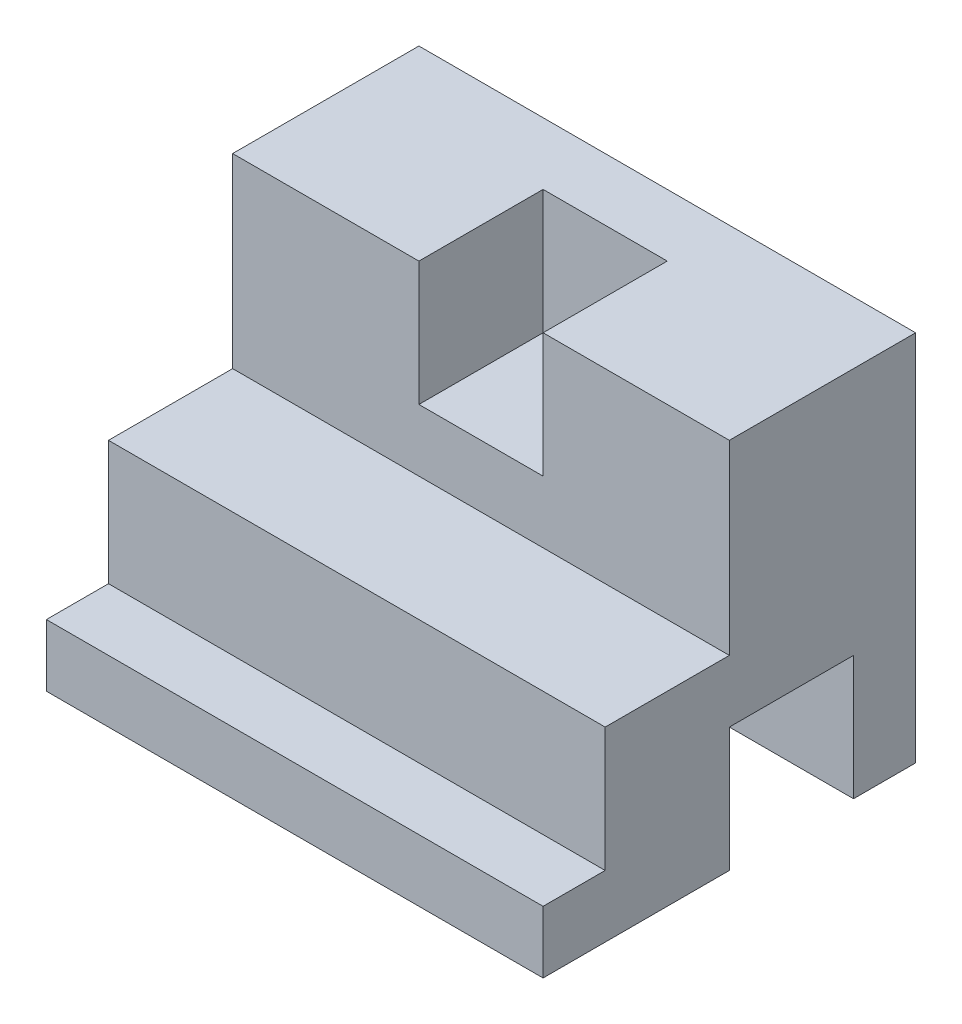
ISO-10303-21;
HEADER;
FILE_DESCRIPTION(('STEP AP214'),'2;1');
FILE_NAME('part.step','',(''),(''),'','','');
FILE_SCHEMA(('AUTOMOTIVE_DESIGN { 1 0 10303 214 1 1 1 1 }'));
ENDSEC;
DATA;
#1=APPLICATION_CONTEXT('core data for automotive mechanical design processes');
#2=APPLICATION_PROTOCOL_DEFINITION('international standard','automotive_design',2000,#1);
#3=PRODUCT_CONTEXT('',#1,'mechanical');
#4=PRODUCT('Part','Part','',(#3));
#5=PRODUCT_RELATED_PRODUCT_CATEGORY('part','',(#4));
#6=PRODUCT_DEFINITION_FORMATION('','',#4);
#7=PRODUCT_DEFINITION_CONTEXT('part definition',#1,'design');
#8=PRODUCT_DEFINITION('design','',#6,#7);
#9=PRODUCT_DEFINITION_SHAPE('','',#8);
#10=(LENGTH_UNIT() NAMED_UNIT(*) SI_UNIT(.MILLI.,.METRE.));
#11=(NAMED_UNIT(*) PLANE_ANGLE_UNIT() SI_UNIT($,.RADIAN.));
#12=(NAMED_UNIT(*) SI_UNIT($,.STERADIAN.) SOLID_ANGLE_UNIT());
#13=UNCERTAINTY_MEASURE_WITH_UNIT(LENGTH_MEASURE(1.E-05),#10,'distance_accuracy_value','');
#14=(GEOMETRIC_REPRESENTATION_CONTEXT(3) GLOBAL_UNCERTAINTY_ASSIGNED_CONTEXT((#13)) GLOBAL_UNIT_ASSIGNED_CONTEXT((#10,
#11,#12)) REPRESENTATION_CONTEXT('',''));
#15=CARTESIAN_POINT('',(0.,0.,0.));
#16=DIRECTION('',(0.,0.,1.));
#17=DIRECTION('',(1.,0.,0.));
#18=AXIS2_PLACEMENT_3D('',#15,#16,#17);
#19=CARTESIAN_POINT('',(0.,0.,-152.4));
#20=DIRECTION('',(0.,-1.,0.));
#21=DIRECTION('',(0.,0.,-1.));
#22=AXIS2_PLACEMENT_3D('',#19,#20,#21);
#23=PLANE('',#22);
#24=DIRECTION('',(1.,0.,0.));
#25=VECTOR('',#24,1.);
#26=CARTESIAN_POINT('',(0.,0.,-76.2));
#27=LINE('',#26,#25);
#28=CARTESIAN_POINT('',(0.,0.,-76.2));
#29=VERTEX_POINT('',#28);
#30=CARTESIAN_POINT('',(203.2,0.,-76.2));
#31=VERTEX_POINT('',#30);
#32=EDGE_CURVE('E192',#29,#31,#27,.T.);
#33=ORIENTED_EDGE('',*,*,#32,.T.);
#34=DIRECTION('',(0.,0.,1.));
#35=VECTOR('',#34,1.);
#36=CARTESIAN_POINT('',(203.2,0.,-152.4));
#37=LINE('',#36,#35);
#38=CARTESIAN_POINT('',(203.2,0.,0.));
#39=VERTEX_POINT('',#38);
#40=EDGE_CURVE('E259',#31,#39,#37,.T.);
#41=ORIENTED_EDGE('',*,*,#40,.T.);
#42=DIRECTION('',(1.,0.,0.));
#43=VECTOR('',#42,1.);
#44=CARTESIAN_POINT('',(0.,0.,0.));
#45=LINE('',#44,#43);
#46=CARTESIAN_POINT('',(0.,0.,0.));
#47=VERTEX_POINT('',#46);
#48=EDGE_CURVE('E251',#47,#39,#45,.T.);
#49=ORIENTED_EDGE('',*,*,#48,.F.);
#50=DIRECTION('',(0.,0.,1.));
#51=VECTOR('',#50,1.);
#52=CARTESIAN_POINT('',(0.,0.,-152.4));
#53=LINE('',#52,#51);
#54=EDGE_CURVE('E248',#29,#47,#53,.T.);
#55=ORIENTED_EDGE('',*,*,#54,.F.);
#56=EDGE_LOOP('',(#33,#41,#49,#55));
#57=FACE_BOUND('',#56,.T.);
#58=ADVANCED_FACE('F33',(#57),#23,.T.);
#59=CARTESIAN_POINT('',(0.,0.,-152.4));
#60=DIRECTION('',(-1.,0.,0.));
#61=DIRECTION('',(0.,0.,1.));
#62=AXIS2_PLACEMENT_3D('',#59,#60,#61);
#63=PLANE('',#62);
#64=DIRECTION('',(0.,-1.,0.));
#65=VECTOR('',#64,1.);
#66=CARTESIAN_POINT('',(0.,0.,-76.2));
#67=LINE('',#66,#65);
#68=CARTESIAN_POINT('',(0.,50.8,-76.2));
#69=VERTEX_POINT('',#68);
#70=EDGE_CURVE('E181',#69,#29,#67,.T.);
#71=ORIENTED_EDGE('',*,*,#70,.T.);
#72=ORIENTED_EDGE('',*,*,#54,.T.);
#73=DIRECTION('',(0.,-1.,0.));
#74=VECTOR('',#73,1.);
#75=CARTESIAN_POINT('',(0.,0.,0.));
#76=LINE('',#75,#74);
#77=CARTESIAN_POINT('',(0.,25.4,0.));
#78=VERTEX_POINT('',#77);
#79=EDGE_CURVE('E227',#78,#47,#76,.T.);
#80=ORIENTED_EDGE('',*,*,#79,.F.);
#81=DIRECTION('',(0.,0.,-1.));
#82=VECTOR('',#81,1.);
#83=CARTESIAN_POINT('',(0.,25.4,0.));
#84=LINE('',#83,#82);
#85=CARTESIAN_POINT('',(0.,25.4,-25.4));
#86=VERTEX_POINT('',#85);
#87=EDGE_CURVE('E201',#78,#86,#84,.T.);
#88=ORIENTED_EDGE('',*,*,#87,.T.);
#89=DIRECTION('',(0.,1.,0.));
#90=VECTOR('',#89,1.);
#91=CARTESIAN_POINT('',(0.,25.4,-25.4));
#92=LINE('',#91,#90);
#93=CARTESIAN_POINT('',(0.,76.2,-25.4));
#94=VERTEX_POINT('',#93);
#95=EDGE_CURVE('E204',#86,#94,#92,.T.);
#96=ORIENTED_EDGE('',*,*,#95,.T.);
#97=DIRECTION('',(0.,0.,-1.));
#98=VECTOR('',#97,1.);
#99=CARTESIAN_POINT('',(0.,76.2,-25.4));
#100=LINE('',#99,#98);
#101=CARTESIAN_POINT('',(0.,76.2,-76.2));
#102=VERTEX_POINT('',#101);
#103=EDGE_CURVE('E208',#94,#102,#100,.T.);
#104=ORIENTED_EDGE('',*,*,#103,.T.);
#105=DIRECTION('',(0.,1.,0.));
#106=VECTOR('',#105,1.);
#107=CARTESIAN_POINT('',(0.,76.2,-76.2));
#108=LINE('',#107,#106);
#109=CARTESIAN_POINT('',(0.,152.4,-76.2));
#110=VERTEX_POINT('',#109);
#111=EDGE_CURVE('E211',#102,#110,#108,.T.);
#112=ORIENTED_EDGE('',*,*,#111,.T.);
#113=DIRECTION('',(0.,0.,1.));
#114=VECTOR('',#113,1.);
#115=CARTESIAN_POINT('',(0.,152.4,-152.4));
#116=LINE('',#115,#114);
#117=CARTESIAN_POINT('',(0.,152.4,-152.4));
#118=VERTEX_POINT('',#117);
#119=EDGE_CURVE('E11',#118,#110,#116,.T.);
#120=ORIENTED_EDGE('',*,*,#119,.F.);
#121=DIRECTION('',(0.,-1.,0.));
#122=VECTOR('',#121,1.);
#123=CARTESIAN_POINT('',(0.,0.,-152.4));
#124=LINE('',#123,#122);
#125=CARTESIAN_POINT('',(0.,0.,-152.4));
#126=VERTEX_POINT('',#125);
#127=EDGE_CURVE('E235',#118,#126,#124,.T.);
#128=ORIENTED_EDGE('',*,*,#127,.T.);
#129=CARTESIAN_POINT('',(0.,0.,-127.));
#130=VERTEX_POINT('',#129);
#131=EDGE_CURVE('E37',#126,#130,#53,.T.);
#132=ORIENTED_EDGE('',*,*,#131,.T.);
#133=DIRECTION('',(0.,1.,0.));
#134=VECTOR('',#133,1.);
#135=CARTESIAN_POINT('',(0.,50.8,-127.));
#136=LINE('',#135,#134);
#137=CARTESIAN_POINT('',(0.,50.8,-127.));
#138=VERTEX_POINT('',#137);
#139=EDGE_CURVE('E58',#130,#138,#136,.T.);
#140=ORIENTED_EDGE('',*,*,#139,.T.);
#141=DIRECTION('',(0.,0.,1.));
#142=VECTOR('',#141,1.);
#143=CARTESIAN_POINT('',(0.,50.8,-76.2));
#144=LINE('',#143,#142);
#145=EDGE_CURVE('E177',#138,#69,#144,.T.);
#146=ORIENTED_EDGE('',*,*,#145,.T.);
#147=EDGE_LOOP('',(#71,#72,#80,#88,#96,#104,#112,#120,#128,#132,#140,#146));
#148=FACE_BOUND('',#147,.T.);
#149=ADVANCED_FACE('F35',(#148),#63,.T.);
#150=CARTESIAN_POINT('',(0.,152.4,-152.4));
#151=DIRECTION('',(0.,1.,0.));
#152=DIRECTION('',(0.,0.,1.));
#153=AXIS2_PLACEMENT_3D('',#150,#151,#152);
#154=PLANE('',#153);
#155=DIRECTION('',(0.,0.,1.));
#156=VECTOR('',#155,1.);
#157=CARTESIAN_POINT('',(76.2,152.4,-76.2));
#158=LINE('',#157,#156);
#159=CARTESIAN_POINT('',(76.2,152.4,-127.));
#160=VERTEX_POINT('',#159);
#161=CARTESIAN_POINT('',(76.2,152.4,-76.2));
#162=VERTEX_POINT('',#161);
#163=EDGE_CURVE('E335',#160,#162,#158,.T.);
#164=ORIENTED_EDGE('',*,*,#163,.F.);
#165=DIRECTION('',(-1.,0.,0.));
#166=VECTOR('',#165,1.);
#167=CARTESIAN_POINT('',(76.2,152.4,-127.));
#168=LINE('',#167,#166);
#169=CARTESIAN_POINT('',(127.,152.4,-127.));
#170=VERTEX_POINT('',#169);
#171=EDGE_CURVE('E337',#170,#160,#168,.T.);
#172=ORIENTED_EDGE('',*,*,#171,.F.);
#173=DIRECTION('',(0.,0.,-1.));
#174=VECTOR('',#173,1.);
#175=CARTESIAN_POINT('',(127.,152.4,-76.2));
#176=LINE('',#175,#174);
#177=CARTESIAN_POINT('',(127.,152.4,-76.2));
#178=VERTEX_POINT('',#177);
#179=EDGE_CURVE('E339',#178,#170,#176,.T.);
#180=ORIENTED_EDGE('',*,*,#179,.F.);
#181=DIRECTION('',(1.,0.,0.));
#182=VECTOR('',#181,1.);
#183=CARTESIAN_POINT('',(0.,152.4,-76.2));
#184=LINE('',#183,#182);
#185=CARTESIAN_POINT('',(203.2,152.4,-76.2));
#186=VERTEX_POINT('',#185);
#187=EDGE_CURVE('E168',#178,#186,#184,.T.);
#188=ORIENTED_EDGE('',*,*,#187,.T.);
#189=DIRECTION('',(0.,0.,1.));
#190=VECTOR('',#189,1.);
#191=CARTESIAN_POINT('',(203.2,152.4,-152.4));
#192=LINE('',#191,#190);
#193=CARTESIAN_POINT('',(203.2,152.4,-152.4));
#194=VERTEX_POINT('',#193);
#195=EDGE_CURVE('E42',#194,#186,#192,.T.);
#196=ORIENTED_EDGE('',*,*,#195,.F.);
#197=DIRECTION('',(-1.,0.,0.));
#198=VECTOR('',#197,1.);
#199=CARTESIAN_POINT('',(0.,152.4,-152.4));
#200=LINE('',#199,#198);
#201=EDGE_CURVE('E245',#194,#118,#200,.T.);
#202=ORIENTED_EDGE('',*,*,#201,.T.);
#203=ORIENTED_EDGE('',*,*,#119,.T.);
#204=EDGE_CURVE('E224',#110,#162,#184,.T.);
#205=ORIENTED_EDGE('',*,*,#204,.T.);
#206=EDGE_LOOP('',(#164,#172,#180,#188,#196,#202,#203,#205));
#207=FACE_BOUND('',#206,.T.);
#208=ADVANCED_FACE('F278',(#207),#154,.T.);
#209=CARTESIAN_POINT('',(203.2,0.,-152.4));
#210=DIRECTION('',(1.,0.,0.));
#211=DIRECTION('',(0.,0.,-1.));
#212=AXIS2_PLACEMENT_3D('',#209,#210,#211);
#213=PLANE('',#212);
#214=DIRECTION('',(0.,-1.,0.));
#215=VECTOR('',#214,1.);
#216=CARTESIAN_POINT('',(203.2,0.,-76.2));
#217=LINE('',#216,#215);
#218=CARTESIAN_POINT('',(203.2,50.8,-76.2));
#219=VERTEX_POINT('',#218);
#220=EDGE_CURVE('E178',#219,#31,#217,.T.);
#221=ORIENTED_EDGE('',*,*,#220,.F.);
#222=DIRECTION('',(0.,0.,1.));
#223=VECTOR('',#222,1.);
#224=CARTESIAN_POINT('',(203.2,50.8,-76.2));
#225=LINE('',#224,#223);
#226=CARTESIAN_POINT('',(203.2,50.8,-127.));
#227=VERTEX_POINT('',#226);
#228=EDGE_CURVE('E188',#227,#219,#225,.T.);
#229=ORIENTED_EDGE('',*,*,#228,.F.);
#230=DIRECTION('',(0.,1.,0.));
#231=VECTOR('',#230,1.);
#232=CARTESIAN_POINT('',(203.2,50.8,-127.));
#233=LINE('',#232,#231);
#234=CARTESIAN_POINT('',(203.2,0.,-127.));
#235=VERTEX_POINT('',#234);
#236=EDGE_CURVE('E185',#235,#227,#233,.T.);
#237=ORIENTED_EDGE('',*,*,#236,.F.);
#238=CARTESIAN_POINT('',(203.2,0.,-152.4));
#239=VERTEX_POINT('',#238);
#240=EDGE_CURVE('E257',#239,#235,#37,.T.);
#241=ORIENTED_EDGE('',*,*,#240,.F.);
#242=DIRECTION('',(0.,1.,0.));
#243=VECTOR('',#242,1.);
#244=CARTESIAN_POINT('',(203.2,0.,-152.4));
#245=LINE('',#244,#243);
#246=EDGE_CURVE('E242',#239,#194,#245,.T.);
#247=ORIENTED_EDGE('',*,*,#246,.T.);
#248=ORIENTED_EDGE('',*,*,#195,.T.);
#249=DIRECTION('',(0.,1.,0.));
#250=VECTOR('',#249,1.);
#251=CARTESIAN_POINT('',(203.2,76.2,-76.2));
#252=LINE('',#251,#250);
#253=CARTESIAN_POINT('',(203.2,76.2,-76.2));
#254=VERTEX_POINT('',#253);
#255=EDGE_CURVE('E205',#254,#186,#252,.T.);
#256=ORIENTED_EDGE('',*,*,#255,.F.);
#257=DIRECTION('',(0.,0.,-1.));
#258=VECTOR('',#257,1.);
#259=CARTESIAN_POINT('',(203.2,76.2,-25.4));
#260=LINE('',#259,#258);
#261=CARTESIAN_POINT('',(203.2,76.2,-25.4));
#262=VERTEX_POINT('',#261);
#263=EDGE_CURVE('E220',#262,#254,#260,.T.);
#264=ORIENTED_EDGE('',*,*,#263,.F.);
#265=DIRECTION('',(0.,1.,0.));
#266=VECTOR('',#265,1.);
#267=CARTESIAN_POINT('',(203.2,25.4,-25.4));
#268=LINE('',#267,#266);
#269=CARTESIAN_POINT('',(203.2,25.4,-25.4));
#270=VERTEX_POINT('',#269);
#271=EDGE_CURVE('E217',#270,#262,#268,.T.);
#272=ORIENTED_EDGE('',*,*,#271,.F.);
#273=DIRECTION('',(0.,0.,-1.));
#274=VECTOR('',#273,1.);
#275=CARTESIAN_POINT('',(203.2,25.4,0.));
#276=LINE('',#275,#274);
#277=CARTESIAN_POINT('',(203.2,25.4,0.));
#278=VERTEX_POINT('',#277);
#279=EDGE_CURVE('E195',#278,#270,#276,.T.);
#280=ORIENTED_EDGE('',*,*,#279,.F.);
#281=DIRECTION('',(0.,1.,0.));
#282=VECTOR('',#281,1.);
#283=CARTESIAN_POINT('',(203.2,0.,0.));
#284=LINE('',#283,#282);
#285=EDGE_CURVE('E239',#39,#278,#284,.T.);
#286=ORIENTED_EDGE('',*,*,#285,.F.);
#287=ORIENTED_EDGE('',*,*,#40,.F.);
#288=EDGE_LOOP('',(#221,#229,#237,#241,#247,#248,#256,#264,#272,#280,#286,#287));
#289=FACE_BOUND('',#288,.T.);
#290=ADVANCED_FACE('F282',(#289),#213,.T.);
#291=DIRECTION('',(1.,0.,0.));
#292=VECTOR('',#291,1.);
#293=CARTESIAN_POINT('',(0.,0.,-127.));
#294=LINE('',#293,#292);
#295=EDGE_CURVE('E184',#130,#235,#294,.T.);
#296=ORIENTED_EDGE('',*,*,#295,.F.);
#297=ORIENTED_EDGE('',*,*,#131,.F.);
#298=DIRECTION('',(1.,0.,0.));
#299=VECTOR('',#298,1.);
#300=CARTESIAN_POINT('',(0.,0.,-152.4));
#301=LINE('',#300,#299);
#302=EDGE_CURVE('E238',#126,#239,#301,.T.);
#303=ORIENTED_EDGE('',*,*,#302,.T.);
#304=ORIENTED_EDGE('',*,*,#240,.T.);
#305=EDGE_LOOP('',(#296,#297,#303,#304));
#306=FACE_BOUND('',#305,.T.);
#307=ADVANCED_FACE('F274',(#306),#23,.T.);
#308=CARTESIAN_POINT('',(0.,0.,-152.4));
#309=DIRECTION('',(0.,0.,-1.));
#310=DIRECTION('',(-1.,0.,0.));
#311=AXIS2_PLACEMENT_3D('',#308,#309,#310);
#312=PLANE('',#311);
#313=ORIENTED_EDGE('',*,*,#127,.F.);
#314=ORIENTED_EDGE('',*,*,#201,.F.);
#315=ORIENTED_EDGE('',*,*,#246,.F.);
#316=ORIENTED_EDGE('',*,*,#302,.F.);
#317=EDGE_LOOP('',(#313,#314,#315,#316));
#318=FACE_BOUND('',#317,.T.);
#319=ADVANCED_FACE('F281',(#318),#312,.T.);
#320=CARTESIAN_POINT('',(0.,0.,0.));
#321=DIRECTION('',(0.,0.,-1.));
#322=DIRECTION('',(-1.,0.,0.));
#323=AXIS2_PLACEMENT_3D('',#320,#321,#322);
#324=PLANE('',#323);
#325=ORIENTED_EDGE('',*,*,#285,.T.);
#326=DIRECTION('',(1.,0.,0.));
#327=VECTOR('',#326,1.);
#328=CARTESIAN_POINT('',(0.,25.4,0.));
#329=LINE('',#328,#327);
#330=EDGE_CURVE('E214',#78,#278,#329,.T.);
#331=ORIENTED_EDGE('',*,*,#330,.F.);
#332=ORIENTED_EDGE('',*,*,#79,.T.);
#333=ORIENTED_EDGE('',*,*,#48,.T.);
#334=EDGE_LOOP('',(#325,#331,#332,#333));
#335=FACE_BOUND('',#334,.T.);
#336=ADVANCED_FACE('F272',(#335),#324,.F.);
#337=CARTESIAN_POINT('',(0.,76.2,-76.2));
#338=DIRECTION('',(0.,0.,-1.));
#339=DIRECTION('',(-1.,0.,0.));
#340=AXIS2_PLACEMENT_3D('',#337,#338,#339);
#341=PLANE('',#340);
#342=DIRECTION('',(1.,0.,0.));
#343=VECTOR('',#342,1.);
#344=CARTESIAN_POINT('',(76.2,101.6,-76.2));
#345=LINE('',#344,#343);
#346=CARTESIAN_POINT('',(76.2,101.6,-76.2));
#347=VERTEX_POINT('',#346);
#348=CARTESIAN_POINT('',(127.,101.6,-76.2));
#349=VERTEX_POINT('',#348);
#350=EDGE_CURVE('E158',#347,#349,#345,.T.);
#351=ORIENTED_EDGE('',*,*,#350,.F.);
#352=DIRECTION('',(0.,1.,0.));
#353=VECTOR('',#352,1.);
#354=CARTESIAN_POINT('',(76.2,101.6,-76.2));
#355=LINE('',#354,#353);
#356=EDGE_CURVE('E169',#347,#162,#355,.T.);
#357=ORIENTED_EDGE('',*,*,#356,.T.);
#358=ORIENTED_EDGE('',*,*,#204,.F.);
#359=ORIENTED_EDGE('',*,*,#111,.F.);
#360=DIRECTION('',(1.,0.,0.));
#361=VECTOR('',#360,1.);
#362=CARTESIAN_POINT('',(0.,76.2,-76.2));
#363=LINE('',#362,#361);
#364=EDGE_CURVE('E228',#102,#254,#363,.T.);
#365=ORIENTED_EDGE('',*,*,#364,.T.);
#366=ORIENTED_EDGE('',*,*,#255,.T.);
#367=ORIENTED_EDGE('',*,*,#187,.F.);
#368=DIRECTION('',(0.,1.,0.));
#369=VECTOR('',#368,1.);
#370=CARTESIAN_POINT('',(127.,101.6,-76.2));
#371=LINE('',#370,#369);
#372=EDGE_CURVE('E153',#349,#178,#371,.T.);
#373=ORIENTED_EDGE('',*,*,#372,.F.);
#374=EDGE_LOOP('',(#351,#357,#358,#359,#365,#366,#367,#373));
#375=FACE_BOUND('',#374,.T.);
#376=ADVANCED_FACE('F166',(#375),#341,.F.);
#377=CARTESIAN_POINT('',(0.,76.2,-25.4));
#378=DIRECTION('',(0.,-1.,0.));
#379=DIRECTION('',(0.,0.,-1.));
#380=AXIS2_PLACEMENT_3D('',#377,#378,#379);
#381=PLANE('',#380);
#382=ORIENTED_EDGE('',*,*,#263,.T.);
#383=ORIENTED_EDGE('',*,*,#364,.F.);
#384=ORIENTED_EDGE('',*,*,#103,.F.);
#385=DIRECTION('',(1.,0.,0.));
#386=VECTOR('',#385,1.);
#387=CARTESIAN_POINT('',(0.,76.2,-25.4));
#388=LINE('',#387,#386);
#389=EDGE_CURVE('E230',#94,#262,#388,.T.);
#390=ORIENTED_EDGE('',*,*,#389,.T.);
#391=EDGE_LOOP('',(#382,#383,#384,#390));
#392=FACE_BOUND('',#391,.T.);
#393=ADVANCED_FACE('F320',(#392),#381,.F.);
#394=CARTESIAN_POINT('',(0.,25.4,-25.4));
#395=DIRECTION('',(0.,0.,-1.));
#396=DIRECTION('',(-1.,0.,0.));
#397=AXIS2_PLACEMENT_3D('',#394,#395,#396);
#398=PLANE('',#397);
#399=ORIENTED_EDGE('',*,*,#271,.T.);
#400=ORIENTED_EDGE('',*,*,#389,.F.);
#401=ORIENTED_EDGE('',*,*,#95,.F.);
#402=DIRECTION('',(1.,0.,0.));
#403=VECTOR('',#402,1.);
#404=CARTESIAN_POINT('',(0.,25.4,-25.4));
#405=LINE('',#404,#403);
#406=EDGE_CURVE('E232',#86,#270,#405,.T.);
#407=ORIENTED_EDGE('',*,*,#406,.T.);
#408=EDGE_LOOP('',(#399,#400,#401,#407));
#409=FACE_BOUND('',#408,.T.);
#410=ADVANCED_FACE('F309',(#409),#398,.F.);
#411=CARTESIAN_POINT('',(0.,25.4,0.));
#412=DIRECTION('',(0.,-1.,0.));
#413=DIRECTION('',(0.,0.,-1.));
#414=AXIS2_PLACEMENT_3D('',#411,#412,#413);
#415=PLANE('',#414);
#416=ORIENTED_EDGE('',*,*,#279,.T.);
#417=ORIENTED_EDGE('',*,*,#406,.F.);
#418=ORIENTED_EDGE('',*,*,#87,.F.);
#419=ORIENTED_EDGE('',*,*,#330,.T.);
#420=EDGE_LOOP('',(#416,#417,#418,#419));
#421=FACE_BOUND('',#420,.T.);
#422=ADVANCED_FACE('F302',(#421),#415,.F.);
#423=CARTESIAN_POINT('',(0.,0.,-76.2));
#424=DIRECTION('',(0.,0.,1.));
#425=DIRECTION('',(1.,0.,0.));
#426=AXIS2_PLACEMENT_3D('',#423,#424,#425);
#427=PLANE('',#426);
#428=ORIENTED_EDGE('',*,*,#220,.T.);
#429=ORIENTED_EDGE('',*,*,#32,.F.);
#430=ORIENTED_EDGE('',*,*,#70,.F.);
#431=DIRECTION('',(1.,0.,0.));
#432=VECTOR('',#431,1.);
#433=CARTESIAN_POINT('',(0.,50.8,-76.2));
#434=LINE('',#433,#432);
#435=EDGE_CURVE('E196',#69,#219,#434,.T.);
#436=ORIENTED_EDGE('',*,*,#435,.T.);
#437=EDGE_LOOP('',(#428,#429,#430,#436));
#438=FACE_BOUND('',#437,.T.);
#439=ADVANCED_FACE('F300',(#438),#427,.F.);
#440=CARTESIAN_POINT('',(0.,50.8,-76.2));
#441=DIRECTION('',(0.,1.,0.));
#442=DIRECTION('',(0.,0.,1.));
#443=AXIS2_PLACEMENT_3D('',#440,#441,#442);
#444=PLANE('',#443);
#445=ORIENTED_EDGE('',*,*,#228,.T.);
#446=ORIENTED_EDGE('',*,*,#435,.F.);
#447=ORIENTED_EDGE('',*,*,#145,.F.);
#448=DIRECTION('',(1.,0.,0.));
#449=VECTOR('',#448,1.);
#450=CARTESIAN_POINT('',(0.,50.8,-127.));
#451=LINE('',#450,#449);
#452=EDGE_CURVE('E198',#138,#227,#451,.T.);
#453=ORIENTED_EDGE('',*,*,#452,.T.);
#454=EDGE_LOOP('',(#445,#446,#447,#453));
#455=FACE_BOUND('',#454,.T.);
#456=ADVANCED_FACE('F297',(#455),#444,.F.);
#457=CARTESIAN_POINT('',(0.,50.8,-127.));
#458=DIRECTION('',(0.,0.,-1.));
#459=DIRECTION('',(-1.,0.,0.));
#460=AXIS2_PLACEMENT_3D('',#457,#458,#459);
#461=PLANE('',#460);
#462=ORIENTED_EDGE('',*,*,#236,.T.);
#463=ORIENTED_EDGE('',*,*,#452,.F.);
#464=ORIENTED_EDGE('',*,*,#139,.F.);
#465=ORIENTED_EDGE('',*,*,#295,.T.);
#466=EDGE_LOOP('',(#462,#463,#464,#465));
#467=FACE_BOUND('',#466,.T.);
#468=ADVANCED_FACE('F292',(#467),#461,.F.);
#469=CARTESIAN_POINT('',(76.2,101.6,-76.2));
#470=DIRECTION('',(-1.,0.,0.));
#471=DIRECTION('',(0.,0.,1.));
#472=AXIS2_PLACEMENT_3D('',#469,#470,#471);
#473=PLANE('',#472);
#474=ORIENTED_EDGE('',*,*,#163,.T.);
#475=ORIENTED_EDGE('',*,*,#356,.F.);
#476=DIRECTION('',(0.,0.,1.));
#477=VECTOR('',#476,1.);
#478=CARTESIAN_POINT('',(76.2,101.6,-76.2));
#479=LINE('',#478,#477);
#480=CARTESIAN_POINT('',(76.2,101.6,-127.));
#481=VERTEX_POINT('',#480);
#482=EDGE_CURVE('E50',#481,#347,#479,.T.);
#483=ORIENTED_EDGE('',*,*,#482,.F.);
#484=DIRECTION('',(0.,1.,0.));
#485=VECTOR('',#484,1.);
#486=CARTESIAN_POINT('',(76.2,101.6,-127.));
#487=LINE('',#486,#485);
#488=EDGE_CURVE('E171',#481,#160,#487,.T.);
#489=ORIENTED_EDGE('',*,*,#488,.T.);
#490=EDGE_LOOP('',(#474,#475,#483,#489));
#491=FACE_BOUND('',#490,.T.);
#492=ADVANCED_FACE('F313',(#491),#473,.F.);
#493=CARTESIAN_POINT('',(76.2,101.6,-127.));
#494=DIRECTION('',(0.,0.,-1.));
#495=DIRECTION('',(-1.,0.,0.));
#496=AXIS2_PLACEMENT_3D('',#493,#494,#495);
#497=PLANE('',#496);
#498=ORIENTED_EDGE('',*,*,#171,.T.);
#499=ORIENTED_EDGE('',*,*,#488,.F.);
#500=DIRECTION('',(-1.,0.,0.));
#501=VECTOR('',#500,1.);
#502=CARTESIAN_POINT('',(76.2,101.6,-127.));
#503=LINE('',#502,#501);
#504=CARTESIAN_POINT('',(127.,101.6,-127.));
#505=VERTEX_POINT('',#504);
#506=EDGE_CURVE('E157',#505,#481,#503,.T.);
#507=ORIENTED_EDGE('',*,*,#506,.F.);
#508=DIRECTION('',(0.,1.,0.));
#509=VECTOR('',#508,1.);
#510=CARTESIAN_POINT('',(127.,101.6,-127.));
#511=LINE('',#510,#509);
#512=EDGE_CURVE('E155',#505,#170,#511,.T.);
#513=ORIENTED_EDGE('',*,*,#512,.T.);
#514=EDGE_LOOP('',(#498,#499,#507,#513));
#515=FACE_BOUND('',#514,.T.);
#516=ADVANCED_FACE('F345',(#515),#497,.F.);
#517=CARTESIAN_POINT('',(127.,101.6,-76.2));
#518=DIRECTION('',(1.,0.,0.));
#519=DIRECTION('',(0.,0.,-1.));
#520=AXIS2_PLACEMENT_3D('',#517,#518,#519);
#521=PLANE('',#520);
#522=ORIENTED_EDGE('',*,*,#179,.T.);
#523=ORIENTED_EDGE('',*,*,#512,.F.);
#524=DIRECTION('',(0.,0.,-1.));
#525=VECTOR('',#524,1.);
#526=CARTESIAN_POINT('',(127.,101.6,-76.2));
#527=LINE('',#526,#525);
#528=EDGE_CURVE('E149',#349,#505,#527,.T.);
#529=ORIENTED_EDGE('',*,*,#528,.F.);
#530=ORIENTED_EDGE('',*,*,#372,.T.);
#531=EDGE_LOOP('',(#522,#523,#529,#530));
#532=FACE_BOUND('',#531,.T.);
#533=ADVANCED_FACE('F151',(#532),#521,.F.);
#534=CARTESIAN_POINT('',(0.,101.6,0.));
#535=DIRECTION('',(0.,-1.,0.));
#536=DIRECTION('',(0.,0.,-1.));
#537=AXIS2_PLACEMENT_3D('',#534,#535,#536);
#538=PLANE('',#537);
#539=ORIENTED_EDGE('',*,*,#482,.T.);
#540=ORIENTED_EDGE('',*,*,#350,.T.);
#541=ORIENTED_EDGE('',*,*,#528,.T.);
#542=ORIENTED_EDGE('',*,*,#506,.T.);
#543=EDGE_LOOP('',(#539,#540,#541,#542));
#544=FACE_BOUND('',#543,.T.);
#545=ADVANCED_FACE('F161',(#544),#538,.F.);
#546=CLOSED_SHELL('',(#58,#149,#208,#290,#307,#319,#336,#376,#393,#410,#422,#439,#456,#468,#492,
#516,#533,#545));
#547=MANIFOLD_SOLID_BREP('B2',#546);
#548=ADVANCED_BREP_SHAPE_REPRESENTATION('',(#18,#547),#14);
#549=SHAPE_DEFINITION_REPRESENTATION(#9,#548);
ENDSEC;
END-ISO-10303-21;
